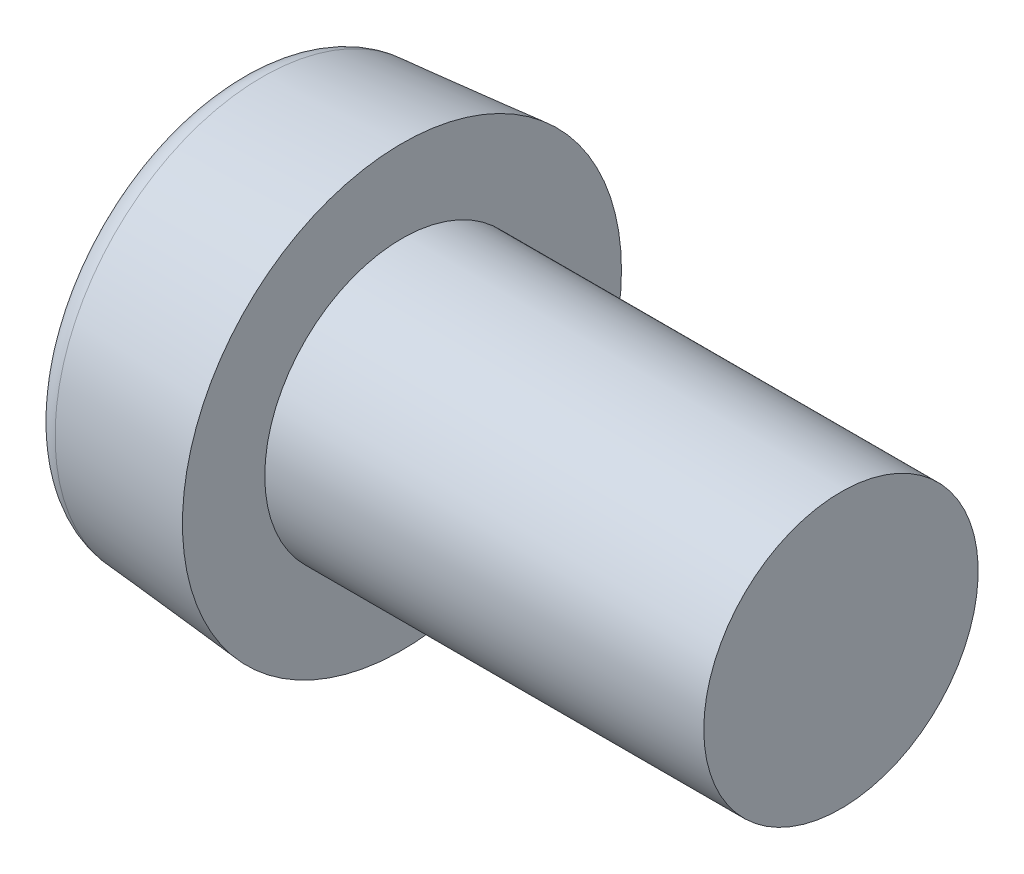
ISO-10303-21;
HEADER;
FILE_DESCRIPTION(('STEP AP214'),'2;1');
FILE_NAME('part.step','',(''),(''),'','','');
FILE_SCHEMA(('AUTOMOTIVE_DESIGN { 1 0 10303 214 1 1 1 1 }'));
ENDSEC;
DATA;
#1=APPLICATION_CONTEXT('core data for automotive mechanical design processes');
#2=APPLICATION_PROTOCOL_DEFINITION('international standard','automotive_design',2000,#1);
#3=PRODUCT_CONTEXT('',#1,'mechanical');
#4=PRODUCT('Part','Part','',(#3));
#5=PRODUCT_RELATED_PRODUCT_CATEGORY('part','',(#4));
#6=PRODUCT_DEFINITION_FORMATION('','',#4);
#7=PRODUCT_DEFINITION_CONTEXT('part definition',#1,'design');
#8=PRODUCT_DEFINITION('design','',#6,#7);
#9=PRODUCT_DEFINITION_SHAPE('','',#8);
#10=(LENGTH_UNIT() NAMED_UNIT(*) SI_UNIT(.MILLI.,.METRE.));
#11=(NAMED_UNIT(*) PLANE_ANGLE_UNIT() SI_UNIT($,.RADIAN.));
#12=(NAMED_UNIT(*) SI_UNIT($,.STERADIAN.) SOLID_ANGLE_UNIT());
#13=UNCERTAINTY_MEASURE_WITH_UNIT(LENGTH_MEASURE(1.E-05),#10,'distance_accuracy_value','');
#14=(GEOMETRIC_REPRESENTATION_CONTEXT(3) GLOBAL_UNCERTAINTY_ASSIGNED_CONTEXT((#13)) GLOBAL_UNIT_ASSIGNED_CONTEXT((#10,
#11,#12)) REPRESENTATION_CONTEXT('',''));
#15=CARTESIAN_POINT('',(0.,0.,0.));
#16=DIRECTION('',(0.,0.,1.));
#17=DIRECTION('',(1.,0.,0.));
#18=AXIS2_PLACEMENT_3D('',#15,#16,#17);
#19=CARTESIAN_POINT('',(0.,0.,0.));
#20=DIRECTION('',(1.,0.,0.));
#21=DIRECTION('',(0.,0.,-1.));
#22=AXIS2_PLACEMENT_3D('',#19,#20,#21);
#23=PLANE('',#22);
#24=CARTESIAN_POINT('',(0.,0.,0.));
#25=DIRECTION('',(1.,0.,0.));
#26=DIRECTION('',(0.,0.,-1.));
#27=AXIS2_PLACEMENT_3D('',#24,#25,#26);
#28=CIRCLE('',#27,6.55873684482703);
#29=CARTESIAN_POINT('',(0.,0.,-6.55873684482703));
#30=VERTEX_POINT('',#29);
#31=EDGE_CURVE('E12',#30,#30,#28,.F.);
#32=ORIENTED_EDGE('',*,*,#31,.T.);
#33=EDGE_LOOP('',(#32));
#34=FACE_BOUND('',#33,.T.);
#35=CARTESIAN_POINT('',(0.,2.86654408652649,-1.655));
#36=CARTESIAN_POINT('',(0.,3.23404973864527,-1.01846153846154));
#37=CARTESIAN_POINT('',(0.,4.41006782542537,0.));
#38=CARTESIAN_POINT('',(0.,2.64604069525523,1.52769230769231));
#39=CARTESIAN_POINT('',(0.,2.20503391271268,3.81923076923077));
#40=CARTESIAN_POINT('',(0.,0.,3.05538461538462));
#41=CARTESIAN_POINT('',(0.,-2.20503391271268,3.81923076923077));
#42=CARTESIAN_POINT('',(0.,-2.64604069525522,1.52769230769231));
#43=CARTESIAN_POINT('',(0.,-4.41006782542537,0.));
#44=CARTESIAN_POINT('',(0.,-2.64604069525522,-1.52769230769231));
#45=CARTESIAN_POINT('',(0.,-2.20503391271269,-3.81923076923077));
#46=CARTESIAN_POINT('',(0.,0.,-3.05538461538462));
#47=CARTESIAN_POINT('',(0.,2.20503391271268,-3.81923076923077));
#48=CARTESIAN_POINT('',(0.,2.49903843440771,-2.29153846153846));
#49=CARTESIAN_POINT('',(0.,2.86654408652649,-1.655));
#50=B_SPLINE_CURVE_WITH_KNOTS('',3,(#35,#36,#37,#38,#39,#40,#41,#42,#43,#44,#45,#46,#47,#48,
#49),.UNSPECIFIED.,.T.,.F.,(4,1,1,1,1,1,1,1,1,1,1,1,4),(0.,0.0833333333333334,0.166666666666667,
0.25,0.333333333333333,0.416666666666667,0.5,0.583333333333333,0.666666666666667,0.75,
0.833333333333333,0.916666666666667,1.),.UNSPECIFIED.);
#51=CARTESIAN_POINT('',(0.,2.86654408652649,-1.655));
#52=VERTEX_POINT('',#51);
#53=EDGE_CURVE('E62',#52,#52,#50,.T.);
#54=ORIENTED_EDGE('',*,*,#53,.T.);
#55=EDGE_LOOP('',(#54));
#56=FACE_BOUND('',#55,.T.);
#57=ADVANCED_FACE('F43',(#34,#56),#23,.F.);
#58=CARTESIAN_POINT('',(6.,0.,0.));
#59=DIRECTION('',(1.,0.,0.));
#60=DIRECTION('',(0.,0.,-1.));
#61=AXIS2_PLACEMENT_3D('',#58,#59,#60);
#62=PLANE('',#61);
#63=CARTESIAN_POINT('',(6.,0.,0.));
#64=DIRECTION('',(1.,0.,0.));
#65=DIRECTION('',(0.,0.,-1.));
#66=AXIS2_PLACEMENT_3D('',#63,#64,#65);
#67=CIRCLE('',#66,8.);
#68=CARTESIAN_POINT('',(6.,0.,-8.));
#69=VERTEX_POINT('',#68);
#70=EDGE_CURVE('E111',#69,#69,#67,.T.);
#71=ORIENTED_EDGE('',*,*,#70,.T.);
#72=EDGE_LOOP('',(#71));
#73=FACE_BOUND('',#72,.T.);
#74=CARTESIAN_POINT('',(6.,0.,0.));
#75=DIRECTION('',(-1.,0.,0.));
#76=DIRECTION('',(0.,0.,1.));
#77=AXIS2_PLACEMENT_3D('',#74,#75,#76);
#78=CIRCLE('',#77,5.);
#79=CARTESIAN_POINT('',(6.,0.,5.));
#80=VERTEX_POINT('',#79);
#81=EDGE_CURVE('E65',#80,#80,#78,.T.);
#82=ORIENTED_EDGE('',*,*,#81,.T.);
#83=EDGE_LOOP('',(#82));
#84=FACE_BOUND('',#83,.T.);
#85=ADVANCED_FACE('F98',(#73,#84),#62,.T.);
#86=CARTESIAN_POINT('',(6.,0.,0.));
#87=DIRECTION('',(1.,0.,0.));
#88=DIRECTION('',(0.,0.,-1.));
#89=AXIS2_PLACEMENT_3D('',#86,#87,#88);
#90=CONICAL_SURFACE('',#89,8.,0.0872664625997167);
#91=CARTESIAN_POINT('',(0.912844257252342,0.,0.));
#92=DIRECTION('',(1.,0.,0.));
#93=DIRECTION('',(0.,0.,-1.));
#94=AXIS2_PLACEMENT_3D('',#91,#92,#93);
#95=CIRCLE('',#94,7.55493154291878);
#96=CARTESIAN_POINT('',(0.912844257252342,0.,-7.55493154291878));
#97=VERTEX_POINT('',#96);
#98=EDGE_CURVE('E50',#97,#97,#95,.T.);
#99=ORIENTED_EDGE('',*,*,#98,.T.);
#100=EDGE_LOOP('',(#99));
#101=FACE_BOUND('',#100,.T.);
#102=ORIENTED_EDGE('',*,*,#70,.F.);
#103=EDGE_LOOP('',(#102));
#104=FACE_BOUND('',#103,.T.);
#105=ADVANCED_FACE('F94',(#101,#104),#90,.T.);
#106=CARTESIAN_POINT('',(22.,5.,0.));
#107=DIRECTION('',(-1.,0.,0.));
#108=DIRECTION('',(0.,0.,1.));
#109=AXIS2_PLACEMENT_3D('',#106,#107,#108);
#110=PLANE('',#109);
#111=CARTESIAN_POINT('',(22.,0.,0.));
#112=DIRECTION('',(-1.,0.,0.));
#113=DIRECTION('',(0.,0.,1.));
#114=AXIS2_PLACEMENT_3D('',#111,#112,#113);
#115=CIRCLE('',#114,5.);
#116=CARTESIAN_POINT('',(22.,0.,5.));
#117=VERTEX_POINT('',#116);
#118=EDGE_CURVE('E113',#117,#117,#115,.T.);
#119=ORIENTED_EDGE('',*,*,#118,.F.);
#120=EDGE_LOOP('',(#119));
#121=FACE_BOUND('',#120,.T.);
#122=ADVANCED_FACE('F90',(#121),#110,.F.);
#123=CARTESIAN_POINT('',(0.,0.,0.));
#124=DIRECTION('',(-1.,0.,0.));
#125=DIRECTION('',(0.,0.,1.));
#126=AXIS2_PLACEMENT_3D('',#123,#124,#125);
#127=CYLINDRICAL_SURFACE('',#126,5.);
#128=ORIENTED_EDGE('',*,*,#81,.F.);
#129=EDGE_LOOP('',(#128));
#130=FACE_BOUND('',#129,.T.);
#131=ORIENTED_EDGE('',*,*,#118,.T.);
#132=EDGE_LOOP('',(#131));
#133=FACE_BOUND('',#132,.T.);
#134=ADVANCED_FACE('F85',(#130,#133),#127,.T.);
#135=CARTESIAN_POINT('',(3.,2.86654408652649,-1.655));
#136=CARTESIAN_POINT('',(3.,3.23404973864527,-1.01846153846154));
#137=CARTESIAN_POINT('',(3.,4.41006782542537,0.));
#138=CARTESIAN_POINT('',(3.,2.64604069525523,1.52769230769231));
#139=CARTESIAN_POINT('',(3.,2.20503391271268,3.81923076923077));
#140=CARTESIAN_POINT('',(3.,0.,3.05538461538462));
#141=CARTESIAN_POINT('',(3.,-2.20503391271268,3.81923076923077));
#142=CARTESIAN_POINT('',(3.,-2.64604069525522,1.52769230769231));
#143=CARTESIAN_POINT('',(3.,-4.41006782542537,0.));
#144=CARTESIAN_POINT('',(3.,-2.64604069525522,-1.52769230769231));
#145=CARTESIAN_POINT('',(3.,-2.20503391271269,-3.81923076923077));
#146=CARTESIAN_POINT('',(3.,0.,-3.05538461538462));
#147=CARTESIAN_POINT('',(3.,2.20503391271268,-3.81923076923077));
#148=CARTESIAN_POINT('',(3.,2.49903843440771,-2.29153846153846));
#149=CARTESIAN_POINT('',(3.,2.86654408652649,-1.655));
#150=B_SPLINE_CURVE_WITH_KNOTS('',3,(#135,#136,#137,#138,#139,#140,#141,#142,#143,#144,#145,
#146,#147,#148,#149),.UNSPECIFIED.,.T.,.F.,(4,1,1,1,1,1,1,1,1,1,1,1,4),(0.,0.0833333333333334,
0.166666666666667,0.25,0.333333333333333,0.416666666666667,0.5,0.583333333333333,
0.666666666666667,0.75,0.833333333333333,0.916666666666667,1.),.UNSPECIFIED.);
#151=DIRECTION('',(-1.,0.,0.));
#152=VECTOR('',#151,1.);
#153=SURFACE_OF_LINEAR_EXTRUSION('',#150,#152);
#154=CARTESIAN_POINT('',(3.,2.86654408652649,-1.655));
#155=CARTESIAN_POINT('',(3.,2.49903843440771,-2.29153846153846));
#156=CARTESIAN_POINT('',(3.,2.20503391271268,-3.81923076923077));
#157=CARTESIAN_POINT('',(3.,0.,-3.05538461538462));
#158=CARTESIAN_POINT('',(3.,-2.20503391271269,-3.81923076923077));
#159=CARTESIAN_POINT('',(3.,-2.64604069525522,-1.52769230769231));
#160=CARTESIAN_POINT('',(3.,-4.41006782542537,0.));
#161=CARTESIAN_POINT('',(3.,-2.64604069525522,1.52769230769231));
#162=CARTESIAN_POINT('',(3.,-2.20503391271268,3.81923076923077));
#163=CARTESIAN_POINT('',(3.,0.,3.05538461538462));
#164=CARTESIAN_POINT('',(3.,2.20503391271268,3.81923076923077));
#165=CARTESIAN_POINT('',(3.,2.64604069525523,1.52769230769231));
#166=CARTESIAN_POINT('',(3.,4.41006782542537,0.));
#167=CARTESIAN_POINT('',(3.,3.23404973864527,-1.01846153846154));
#168=CARTESIAN_POINT('',(3.,2.86654408652649,-1.655));
#169=B_SPLINE_CURVE_WITH_KNOTS('',3,(#154,#155,#156,#157,#158,#159,#160,#161,#162,#163,#164,
#165,#166,#167,#168),.UNSPECIFIED.,.T.,.F.,(4,1,1,1,1,1,1,1,1,1,1,1,4),(0.,0.0833333333333334,
0.166666666666667,0.25,0.333333333333333,0.416666666666667,0.5,0.583333333333333,
0.666666666666667,0.75,0.833333333333333,0.916666666666667,1.),.UNSPECIFIED.);
#170=CARTESIAN_POINT('',(3.,2.86654408652649,-1.655));
#171=VERTEX_POINT('',#170);
#172=EDGE_CURVE('E60',#171,#171,#169,.T.);
#173=ORIENTED_EDGE('',*,*,#172,.F.);
#174=EDGE_LOOP('',(#173));
#175=FACE_BOUND('',#174,.T.);
#176=ORIENTED_EDGE('',*,*,#53,.F.);
#177=EDGE_LOOP('',(#176));
#178=FACE_BOUND('',#177,.T.);
#179=ADVANCED_FACE('F56',(#175,#178),#153,.T.);
#180=CARTESIAN_POINT('',(4.,0.,0.));
#181=CARTESIAN_POINT('',(3.,2.86654408652649,-1.655));
#182=CARTESIAN_POINT('',(4.,0.,0.));
#183=CARTESIAN_POINT('',(3.,2.49903843440771,-2.29153846153846));
#184=CARTESIAN_POINT('',(4.,0.,0.));
#185=CARTESIAN_POINT('',(3.,2.20503391271268,-3.81923076923077));
#186=CARTESIAN_POINT('',(4.,0.,0.));
#187=CARTESIAN_POINT('',(3.,0.,-3.05538461538462));
#188=CARTESIAN_POINT('',(4.,0.,0.));
#189=CARTESIAN_POINT('',(3.,-2.20503391271269,-3.81923076923077));
#190=CARTESIAN_POINT('',(4.,0.,0.));
#191=CARTESIAN_POINT('',(3.,-2.64604069525522,-1.52769230769231));
#192=CARTESIAN_POINT('',(4.,0.,0.));
#193=CARTESIAN_POINT('',(3.,-4.41006782542537,0.));
#194=CARTESIAN_POINT('',(4.,0.,0.));
#195=CARTESIAN_POINT('',(3.,-2.64604069525522,1.52769230769231));
#196=CARTESIAN_POINT('',(4.,0.,0.));
#197=CARTESIAN_POINT('',(3.,-2.20503391271268,3.81923076923077));
#198=CARTESIAN_POINT('',(4.,0.,0.));
#199=CARTESIAN_POINT('',(3.,0.,3.05538461538462));
#200=CARTESIAN_POINT('',(4.,0.,0.));
#201=CARTESIAN_POINT('',(3.,2.20503391271268,3.81923076923077));
#202=CARTESIAN_POINT('',(4.,0.,0.));
#203=CARTESIAN_POINT('',(3.,2.64604069525523,1.52769230769231));
#204=CARTESIAN_POINT('',(4.,0.,0.));
#205=CARTESIAN_POINT('',(3.,4.41006782542537,0.));
#206=CARTESIAN_POINT('',(4.,0.,0.));
#207=CARTESIAN_POINT('',(3.,3.23404973864527,-1.01846153846154));
#208=CARTESIAN_POINT('',(4.,0.,0.));
#209=CARTESIAN_POINT('',(3.,2.86654408652649,-1.655));
#210=B_SPLINE_SURFACE_WITH_KNOTS('',3,1,((#180,#181),(#182,#183),(#184,#185),(#186,#187),(#188,
#189),(#190,#191),(#192,#193),(#194,#195),(#196,#197),(#198,#199),(#200,#201),(#202,#203),(#204,
#205),(#206,#207),(#208,#209)),.UNSPECIFIED.,.T.,.F.,.F.,(4,1,1,1,1,1,1,1,1,1,1,1,4),(2,2),(0.,
0.0833333333333334,0.166666666666667,0.25,0.333333333333333,0.416666666666667,0.5,
0.583333333333333,0.666666666666667,0.75,0.833333333333333,0.916666666666667,1.),(0.,1.),.UNSPECIFIED.);
#211=CARTESIAN_POINT('',(4.,0.,0.));
#212=VERTEX_POINT('',#211);
#213=VERTEX_LOOP('',#212);
#214=FACE_BOUND('',#213,.T.);
#215=ORIENTED_EDGE('',*,*,#172,.T.);
#216=EDGE_LOOP('',(#215));
#217=FACE_BOUND('',#216,.T.);
#218=ADVANCED_FACE('F53',(#214,#217),#210,.F.);
#219=CARTESIAN_POINT('',(1.,0.,0.));
#220=DIRECTION('',(1.,0.,0.));
#221=DIRECTION('',(0.,0.,-1.));
#222=AXIS2_PLACEMENT_3D('',#219,#220,#221);
#223=TOROIDAL_SURFACE('',#222,6.55873684482703,1.);
#224=ORIENTED_EDGE('',*,*,#31,.F.);
#225=EDGE_LOOP('',(#224));
#226=FACE_BOUND('',#225,.T.);
#227=ORIENTED_EDGE('',*,*,#98,.F.);
#228=EDGE_LOOP('',(#227));
#229=FACE_BOUND('',#228,.T.);
#230=ADVANCED_FACE('F45',(#226,#229),#223,.T.);
#231=CLOSED_SHELL('',(#57,#85,#105,#122,#134,#179,#218,#230));
#232=MANIFOLD_SOLID_BREP('B2',#231);
#233=ADVANCED_BREP_SHAPE_REPRESENTATION('',(#18,#232),#14);
#234=SHAPE_DEFINITION_REPRESENTATION(#9,#233);
ENDSEC;
END-ISO-10303-21;
